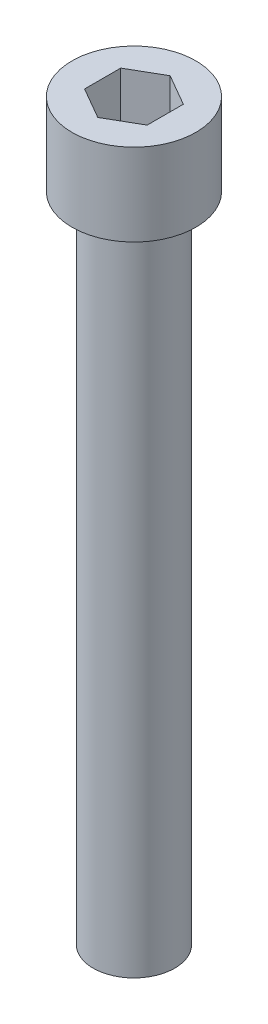
ISO-10303-21;
HEADER;
FILE_DESCRIPTION(('STEP AP214'),'2;1');
FILE_NAME('part.step','',(''),(''),'','','');
FILE_SCHEMA(('AUTOMOTIVE_DESIGN { 1 0 10303 214 1 1 1 1 }'));
ENDSEC;
DATA;
#1=APPLICATION_CONTEXT('core data for automotive mechanical design processes');
#2=APPLICATION_PROTOCOL_DEFINITION('international standard','automotive_design',2000,#1);
#3=PRODUCT_CONTEXT('',#1,'mechanical');
#4=PRODUCT('Part','Part','',(#3));
#5=PRODUCT_RELATED_PRODUCT_CATEGORY('part','',(#4));
#6=PRODUCT_DEFINITION_FORMATION('','',#4);
#7=PRODUCT_DEFINITION_CONTEXT('part definition',#1,'design');
#8=PRODUCT_DEFINITION('design','',#6,#7);
#9=PRODUCT_DEFINITION_SHAPE('','',#8);
#10=(LENGTH_UNIT() NAMED_UNIT(*) SI_UNIT(.MILLI.,.METRE.));
#11=(NAMED_UNIT(*) PLANE_ANGLE_UNIT() SI_UNIT($,.RADIAN.));
#12=(NAMED_UNIT(*) SI_UNIT($,.STERADIAN.) SOLID_ANGLE_UNIT());
#13=UNCERTAINTY_MEASURE_WITH_UNIT(LENGTH_MEASURE(1.E-05),#10,'distance_accuracy_value','');
#14=(GEOMETRIC_REPRESENTATION_CONTEXT(3) GLOBAL_UNCERTAINTY_ASSIGNED_CONTEXT((#13)) GLOBAL_UNIT_ASSIGNED_CONTEXT((#10,
#11,#12)) REPRESENTATION_CONTEXT('',''));
#15=CARTESIAN_POINT('',(0.,0.,0.));
#16=DIRECTION('',(0.,0.,1.));
#17=DIRECTION('',(1.,0.,0.));
#18=AXIS2_PLACEMENT_3D('',#15,#16,#17);
#19=CARTESIAN_POINT('',(0.,6.3,0.));
#20=DIRECTION('',(0.,-1.,0.));
#21=DIRECTION('',(0.,0.,-1.));
#22=AXIS2_PLACEMENT_3D('',#19,#20,#21);
#23=CYLINDRICAL_SURFACE('',#22,4.75);
#24=CARTESIAN_POINT('',(0.,6.3,0.));
#25=DIRECTION('',(0.,1.,0.));
#26=DIRECTION('',(0.,0.,1.));
#27=AXIS2_PLACEMENT_3D('',#24,#25,#26);
#28=CIRCLE('',#27,4.75);
#29=CARTESIAN_POINT('',(0.,6.3,4.75));
#30=VERTEX_POINT('',#29);
#31=EDGE_CURVE('E40',#30,#30,#28,.T.);
#32=ORIENTED_EDGE('',*,*,#31,.F.);
#33=EDGE_LOOP('',(#32));
#34=FACE_BOUND('',#33,.T.);
#35=CARTESIAN_POINT('',(0.,0.,0.));
#36=DIRECTION('',(0.,1.,0.));
#37=DIRECTION('',(0.,0.,1.));
#38=AXIS2_PLACEMENT_3D('',#35,#36,#37);
#39=CIRCLE('',#38,4.75);
#40=CARTESIAN_POINT('',(0.,0.,4.75));
#41=VERTEX_POINT('',#40);
#42=EDGE_CURVE('E35',#41,#41,#39,.T.);
#43=ORIENTED_EDGE('',*,*,#42,.T.);
#44=EDGE_LOOP('',(#43));
#45=FACE_BOUND('',#44,.T.);
#46=ADVANCED_FACE('F32',(#34,#45),#23,.T.);
#47=CARTESIAN_POINT('',(0.,6.3,0.));
#48=DIRECTION('',(0.,1.,0.));
#49=DIRECTION('',(0.,0.,1.));
#50=AXIS2_PLACEMENT_3D('',#47,#48,#49);
#51=PLANE('',#50);
#52=DIRECTION('',(-0.866025403784438,0.,0.500000000000001));
#53=VECTOR('',#52,1.);
#54=CARTESIAN_POINT('',(0.,6.3,-2.7712812921102));
#55=LINE('',#54,#53);
#56=CARTESIAN_POINT('',(0.,6.3,-2.7712812921102));
#57=VERTEX_POINT('',#56);
#58=CARTESIAN_POINT('',(-2.4,6.3,-1.3856406460551));
#59=VERTEX_POINT('',#58);
#60=EDGE_CURVE('E48',#57,#59,#55,.T.);
#61=ORIENTED_EDGE('',*,*,#60,.F.);
#62=DIRECTION('',(-0.866025403784439,0.,-0.5));
#63=VECTOR('',#62,1.);
#64=CARTESIAN_POINT('',(2.4,6.3,-1.3856406460551));
#65=LINE('',#64,#63);
#66=CARTESIAN_POINT('',(2.4,6.3,-1.3856406460551));
#67=VERTEX_POINT('',#66);
#68=EDGE_CURVE('E131',#67,#57,#65,.T.);
#69=ORIENTED_EDGE('',*,*,#68,.F.);
#70=DIRECTION('',(0.,0.,-1.));
#71=VECTOR('',#70,1.);
#72=CARTESIAN_POINT('',(2.4,6.3,1.3856406460551));
#73=LINE('',#72,#71);
#74=CARTESIAN_POINT('',(2.4,6.3,1.3856406460551));
#75=VERTEX_POINT('',#74);
#76=EDGE_CURVE('E129',#75,#67,#73,.T.);
#77=ORIENTED_EDGE('',*,*,#76,.F.);
#78=DIRECTION('',(0.866025403784438,0.,-0.5));
#79=VECTOR('',#78,1.);
#80=CARTESIAN_POINT('',(0.,6.3,2.7712812921102));
#81=LINE('',#80,#79);
#82=CARTESIAN_POINT('',(0.,6.3,2.7712812921102));
#83=VERTEX_POINT('',#82);
#84=EDGE_CURVE('E96',#83,#75,#81,.T.);
#85=ORIENTED_EDGE('',*,*,#84,.F.);
#86=DIRECTION('',(0.866025403784439,0.,0.5));
#87=VECTOR('',#86,1.);
#88=CARTESIAN_POINT('',(-2.4,6.3,1.3856406460551));
#89=LINE('',#88,#87);
#90=CARTESIAN_POINT('',(-2.4,6.3,1.3856406460551));
#91=VERTEX_POINT('',#90);
#92=EDGE_CURVE('E125',#91,#83,#89,.T.);
#93=ORIENTED_EDGE('',*,*,#92,.F.);
#94=DIRECTION('',(0.,0.,1.));
#95=VECTOR('',#94,1.);
#96=CARTESIAN_POINT('',(-2.4,6.3,-1.3856406460551));
#97=LINE('',#96,#95);
#98=EDGE_CURVE('E122',#59,#91,#97,.T.);
#99=ORIENTED_EDGE('',*,*,#98,.F.);
#100=EDGE_LOOP('',(#61,#69,#77,#85,#93,#99));
#101=FACE_BOUND('',#100,.T.);
#102=ORIENTED_EDGE('',*,*,#31,.T.);
#103=EDGE_LOOP('',(#102));
#104=FACE_BOUND('',#103,.T.);
#105=ADVANCED_FACE('F152',(#101,#104),#51,.T.);
#106=CARTESIAN_POINT('',(0.,0.,0.));
#107=DIRECTION('',(0.,1.,0.));
#108=DIRECTION('',(0.,0.,1.));
#109=AXIS2_PLACEMENT_3D('',#106,#107,#108);
#110=PLANE('',#109);
#111=CARTESIAN_POINT('',(0.,0.,0.));
#112=DIRECTION('',(0.,-1.,0.));
#113=DIRECTION('',(0.,0.,-1.));
#114=AXIS2_PLACEMENT_3D('',#111,#112,#113);
#115=CIRCLE('',#114,3.125);
#116=CARTESIAN_POINT('',(0.,0.,-3.125));
#117=VERTEX_POINT('',#116);
#118=EDGE_CURVE('E11',#117,#117,#115,.T.);
#119=ORIENTED_EDGE('',*,*,#118,.F.);
#120=EDGE_LOOP('',(#119));
#121=FACE_BOUND('',#120,.T.);
#122=ORIENTED_EDGE('',*,*,#42,.F.);
#123=EDGE_LOOP('',(#122));
#124=FACE_BOUND('',#123,.T.);
#125=ADVANCED_FACE('F149',(#121,#124),#110,.F.);
#126=CARTESIAN_POINT('',(0.,-50.,0.));
#127=DIRECTION('',(0.,1.,0.));
#128=DIRECTION('',(0.,0.,1.));
#129=AXIS2_PLACEMENT_3D('',#126,#127,#128);
#130=CYLINDRICAL_SURFACE('',#129,3.125);
#131=CARTESIAN_POINT('',(0.,-50.,0.));
#132=DIRECTION('',(0.,-1.,0.));
#133=DIRECTION('',(0.,0.,-1.));
#134=AXIS2_PLACEMENT_3D('',#131,#132,#133);
#135=CIRCLE('',#134,3.125);
#136=CARTESIAN_POINT('',(0.,-50.,-3.125));
#137=VERTEX_POINT('',#136);
#138=EDGE_CURVE('E135',#137,#137,#135,.T.);
#139=ORIENTED_EDGE('',*,*,#138,.F.);
#140=EDGE_LOOP('',(#139));
#141=FACE_BOUND('',#140,.T.);
#142=ORIENTED_EDGE('',*,*,#118,.T.);
#143=EDGE_LOOP('',(#142));
#144=FACE_BOUND('',#143,.T.);
#145=ADVANCED_FACE('F151',(#141,#144),#130,.T.);
#146=CARTESIAN_POINT('',(0.,-50.,0.));
#147=DIRECTION('',(0.,-1.,0.));
#148=DIRECTION('',(0.,0.,-1.));
#149=AXIS2_PLACEMENT_3D('',#146,#147,#148);
#150=PLANE('',#149);
#151=ORIENTED_EDGE('',*,*,#138,.T.);
#152=EDGE_LOOP('',(#151));
#153=FACE_BOUND('',#152,.T.);
#154=ADVANCED_FACE('F158',(#153),#150,.T.);
#155=CARTESIAN_POINT('',(0.,2.05,-2.7712812921102));
#156=DIRECTION('',(-0.500000000000001,0.,-0.866025403784438));
#157=DIRECTION('',(-0.866025403784438,0.,0.500000000000001));
#158=AXIS2_PLACEMENT_3D('',#155,#156,#157);
#159=PLANE('',#158);
#160=ORIENTED_EDGE('',*,*,#60,.T.);
#161=DIRECTION('',(0.,1.,0.));
#162=VECTOR('',#161,1.);
#163=CARTESIAN_POINT('',(-2.4,2.05,-1.3856406460551));
#164=LINE('',#163,#162);
#165=CARTESIAN_POINT('',(-2.4,2.05,-1.3856406460551));
#166=VERTEX_POINT('',#165);
#167=EDGE_CURVE('E78',#166,#59,#164,.T.);
#168=ORIENTED_EDGE('',*,*,#167,.F.);
#169=DIRECTION('',(-0.866025403784438,0.,0.500000000000001));
#170=VECTOR('',#169,1.);
#171=CARTESIAN_POINT('',(0.,2.05,-2.7712812921102));
#172=LINE('',#171,#170);
#173=CARTESIAN_POINT('',(0.,2.05,-2.7712812921102));
#174=VERTEX_POINT('',#173);
#175=EDGE_CURVE('E133',#174,#166,#172,.T.);
#176=ORIENTED_EDGE('',*,*,#175,.F.);
#177=DIRECTION('',(0.,1.,0.));
#178=VECTOR('',#177,1.);
#179=CARTESIAN_POINT('',(0.,2.05,-2.7712812921102));
#180=LINE('',#179,#178);
#181=EDGE_CURVE('E56',#174,#57,#180,.T.);
#182=ORIENTED_EDGE('',*,*,#181,.T.);
#183=EDGE_LOOP('',(#160,#168,#176,#182));
#184=FACE_BOUND('',#183,.T.);
#185=ADVANCED_FACE('F183',(#184),#159,.F.);
#186=CARTESIAN_POINT('',(2.4,2.05,-1.3856406460551));
#187=DIRECTION('',(0.5,0.,-0.866025403784439));
#188=DIRECTION('',(-0.866025403784439,0.,-0.5));
#189=AXIS2_PLACEMENT_3D('',#186,#187,#188);
#190=PLANE('',#189);
#191=ORIENTED_EDGE('',*,*,#68,.T.);
#192=ORIENTED_EDGE('',*,*,#181,.F.);
#193=DIRECTION('',(-0.866025403784439,0.,-0.5));
#194=VECTOR('',#193,1.);
#195=CARTESIAN_POINT('',(2.4,2.05,-1.3856406460551));
#196=LINE('',#195,#194);
#197=CARTESIAN_POINT('',(2.4,2.05,-1.3856406460551));
#198=VERTEX_POINT('',#197);
#199=EDGE_CURVE('E108',#198,#174,#196,.T.);
#200=ORIENTED_EDGE('',*,*,#199,.F.);
#201=DIRECTION('',(0.,1.,0.));
#202=VECTOR('',#201,1.);
#203=CARTESIAN_POINT('',(2.4,2.05,-1.3856406460551));
#204=LINE('',#203,#202);
#205=EDGE_CURVE('E100',#198,#67,#204,.T.);
#206=ORIENTED_EDGE('',*,*,#205,.T.);
#207=EDGE_LOOP('',(#191,#192,#200,#206));
#208=FACE_BOUND('',#207,.T.);
#209=ADVANCED_FACE('F188',(#208),#190,.F.);
#210=CARTESIAN_POINT('',(2.4,2.05,1.3856406460551));
#211=DIRECTION('',(1.,0.,0.));
#212=DIRECTION('',(0.,0.,-1.));
#213=AXIS2_PLACEMENT_3D('',#210,#211,#212);
#214=PLANE('',#213);
#215=ORIENTED_EDGE('',*,*,#76,.T.);
#216=ORIENTED_EDGE('',*,*,#205,.F.);
#217=DIRECTION('',(0.,0.,-1.));
#218=VECTOR('',#217,1.);
#219=CARTESIAN_POINT('',(2.4,2.05,1.3856406460551));
#220=LINE('',#219,#218);
#221=CARTESIAN_POINT('',(2.4,2.05,1.3856406460551));
#222=VERTEX_POINT('',#221);
#223=EDGE_CURVE('E104',#222,#198,#220,.T.);
#224=ORIENTED_EDGE('',*,*,#223,.F.);
#225=DIRECTION('',(0.,1.,0.));
#226=VECTOR('',#225,1.);
#227=CARTESIAN_POINT('',(2.4,2.05,1.3856406460551));
#228=LINE('',#227,#226);
#229=EDGE_CURVE('E89',#222,#75,#228,.T.);
#230=ORIENTED_EDGE('',*,*,#229,.T.);
#231=EDGE_LOOP('',(#215,#216,#224,#230));
#232=FACE_BOUND('',#231,.T.);
#233=ADVANCED_FACE('F105',(#232),#214,.F.);
#234=CARTESIAN_POINT('',(0.,2.05,2.7712812921102));
#235=DIRECTION('',(0.500000000000001,0.,0.866025403784438));
#236=DIRECTION('',(0.866025403784438,0.,-0.500000000000001));
#237=AXIS2_PLACEMENT_3D('',#234,#235,#236);
#238=PLANE('',#237);
#239=ORIENTED_EDGE('',*,*,#84,.T.);
#240=ORIENTED_EDGE('',*,*,#229,.F.);
#241=DIRECTION('',(0.866025403784438,0.,-0.5));
#242=VECTOR('',#241,1.);
#243=CARTESIAN_POINT('',(0.,2.05,2.7712812921102));
#244=LINE('',#243,#242);
#245=CARTESIAN_POINT('',(0.,2.05,2.7712812921102));
#246=VERTEX_POINT('',#245);
#247=EDGE_CURVE('E93',#246,#222,#244,.T.);
#248=ORIENTED_EDGE('',*,*,#247,.F.);
#249=DIRECTION('',(0.,1.,0.));
#250=VECTOR('',#249,1.);
#251=CARTESIAN_POINT('',(0.,2.05,2.7712812921102));
#252=LINE('',#251,#250);
#253=EDGE_CURVE('E101',#246,#83,#252,.T.);
#254=ORIENTED_EDGE('',*,*,#253,.T.);
#255=EDGE_LOOP('',(#239,#240,#248,#254));
#256=FACE_BOUND('',#255,.T.);
#257=ADVANCED_FACE('F91',(#256),#238,.F.);
#258=CARTESIAN_POINT('',(-2.4,2.05,1.3856406460551));
#259=DIRECTION('',(-0.5,0.,0.866025403784439));
#260=DIRECTION('',(0.866025403784439,0.,0.5));
#261=AXIS2_PLACEMENT_3D('',#258,#259,#260);
#262=PLANE('',#261);
#263=ORIENTED_EDGE('',*,*,#92,.T.);
#264=ORIENTED_EDGE('',*,*,#253,.F.);
#265=DIRECTION('',(0.866025403784439,0.,0.5));
#266=VECTOR('',#265,1.);
#267=CARTESIAN_POINT('',(-2.4,2.05,1.3856406460551));
#268=LINE('',#267,#266);
#269=CARTESIAN_POINT('',(-2.4,2.05,1.3856406460551));
#270=VERTEX_POINT('',#269);
#271=EDGE_CURVE('E114',#270,#246,#268,.T.);
#272=ORIENTED_EDGE('',*,*,#271,.F.);
#273=DIRECTION('',(0.,1.,0.));
#274=VECTOR('',#273,1.);
#275=CARTESIAN_POINT('',(-2.4,2.05,1.3856406460551));
#276=LINE('',#275,#274);
#277=EDGE_CURVE('E138',#270,#91,#276,.T.);
#278=ORIENTED_EDGE('',*,*,#277,.T.);
#279=EDGE_LOOP('',(#263,#264,#272,#278));
#280=FACE_BOUND('',#279,.T.);
#281=ADVANCED_FACE('F213',(#280),#262,.F.);
#282=CARTESIAN_POINT('',(-2.4,2.05,-1.3856406460551));
#283=DIRECTION('',(-1.,0.,0.));
#284=DIRECTION('',(0.,0.,1.));
#285=AXIS2_PLACEMENT_3D('',#282,#283,#284);
#286=PLANE('',#285);
#287=ORIENTED_EDGE('',*,*,#98,.T.);
#288=ORIENTED_EDGE('',*,*,#277,.F.);
#289=DIRECTION('',(0.,0.,1.));
#290=VECTOR('',#289,1.);
#291=CARTESIAN_POINT('',(-2.4,2.05,-1.3856406460551));
#292=LINE('',#291,#290);
#293=EDGE_CURVE('E116',#166,#270,#292,.T.);
#294=ORIENTED_EDGE('',*,*,#293,.F.);
#295=ORIENTED_EDGE('',*,*,#167,.T.);
#296=EDGE_LOOP('',(#287,#288,#294,#295));
#297=FACE_BOUND('',#296,.T.);
#298=ADVANCED_FACE('F222',(#297),#286,.F.);
#299=CARTESIAN_POINT('',(0.,2.05,0.));
#300=DIRECTION('',(0.,1.,0.));
#301=DIRECTION('',(0.,0.,1.));
#302=AXIS2_PLACEMENT_3D('',#299,#300,#301);
#303=PLANE('',#302);
#304=ORIENTED_EDGE('',*,*,#175,.T.);
#305=ORIENTED_EDGE('',*,*,#293,.T.);
#306=ORIENTED_EDGE('',*,*,#271,.T.);
#307=ORIENTED_EDGE('',*,*,#247,.T.);
#308=ORIENTED_EDGE('',*,*,#223,.T.);
#309=ORIENTED_EDGE('',*,*,#199,.T.);
#310=EDGE_LOOP('',(#304,#305,#306,#307,#308,#309));
#311=FACE_BOUND('',#310,.T.);
#312=ADVANCED_FACE('F111',(#311),#303,.T.);
#313=CLOSED_SHELL('',(#46,#105,#125,#145,#154,#185,#209,#233,#257,#281,#298,#312));
#314=MANIFOLD_SOLID_BREP('B2',#313);
#315=ADVANCED_BREP_SHAPE_REPRESENTATION('',(#18,#314),#14);
#316=SHAPE_DEFINITION_REPRESENTATION(#9,#315);
ENDSEC;
END-ISO-10303-21;
